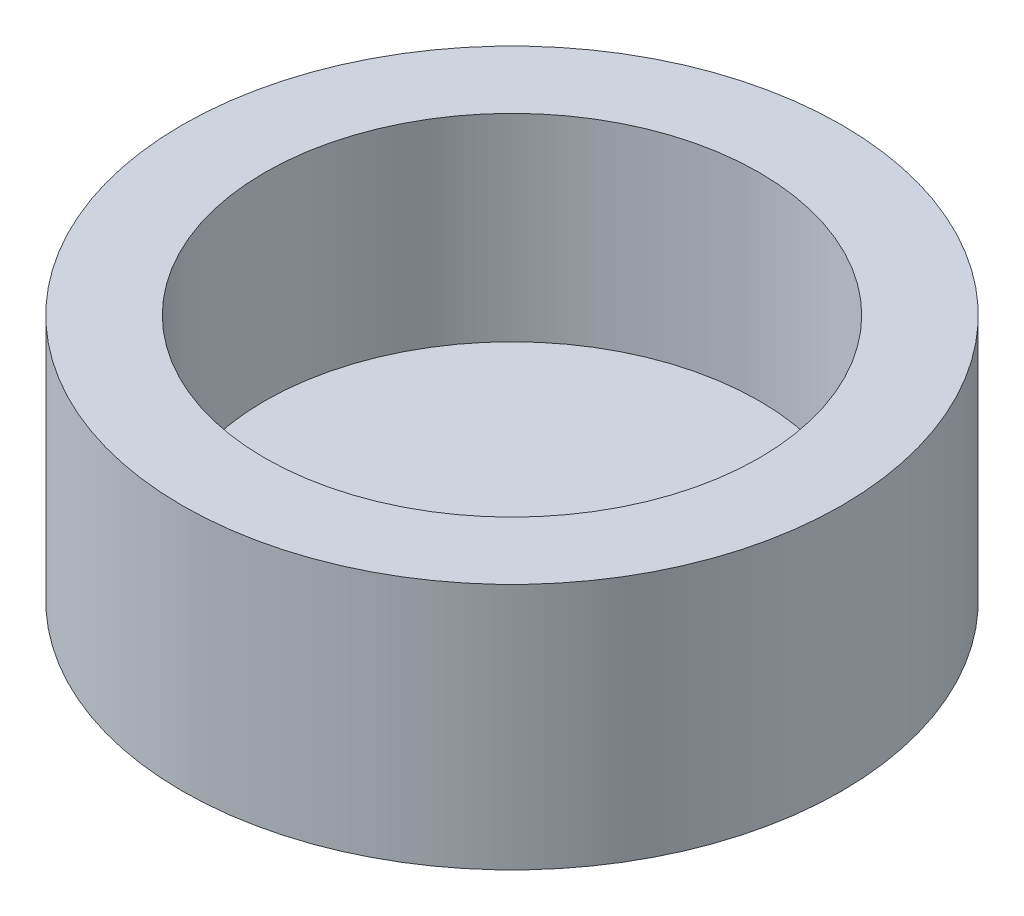
ISO-10303-21;
HEADER;
FILE_DESCRIPTION(('STEP AP214'),'2;1');
FILE_NAME('part.step','',(''),(''),'','','');
FILE_SCHEMA(('AUTOMOTIVE_DESIGN { 1 0 10303 214 1 1 1 1 }'));
ENDSEC;
DATA;
#1=APPLICATION_CONTEXT('core data for automotive mechanical design processes');
#2=APPLICATION_PROTOCOL_DEFINITION('international standard','automotive_design',2000,#1);
#3=PRODUCT_CONTEXT('',#1,'mechanical');
#4=PRODUCT('Part','Part','',(#3));
#5=PRODUCT_RELATED_PRODUCT_CATEGORY('part','',(#4));
#6=PRODUCT_DEFINITION_FORMATION('','',#4);
#7=PRODUCT_DEFINITION_CONTEXT('part definition',#1,'design');
#8=PRODUCT_DEFINITION('design','',#6,#7);
#9=PRODUCT_DEFINITION_SHAPE('','',#8);
#10=(LENGTH_UNIT() NAMED_UNIT(*) SI_UNIT(.MILLI.,.METRE.));
#11=(NAMED_UNIT(*) PLANE_ANGLE_UNIT() SI_UNIT($,.RADIAN.));
#12=(NAMED_UNIT(*) SI_UNIT($,.STERADIAN.) SOLID_ANGLE_UNIT());
#13=UNCERTAINTY_MEASURE_WITH_UNIT(LENGTH_MEASURE(1.E-05),#10,'distance_accuracy_value','');
#14=(GEOMETRIC_REPRESENTATION_CONTEXT(3) GLOBAL_UNCERTAINTY_ASSIGNED_CONTEXT((#13)) GLOBAL_UNIT_ASSIGNED_CONTEXT((#10,
#11,#12)) REPRESENTATION_CONTEXT('',''));
#15=CARTESIAN_POINT('',(0.,0.,0.));
#16=DIRECTION('',(0.,0.,1.));
#17=DIRECTION('',(1.,0.,0.));
#18=AXIS2_PLACEMENT_3D('',#15,#16,#17);
#19=CARTESIAN_POINT('',(0.,19.05,0.));
#20=DIRECTION('',(0.,-1.,0.));
#21=DIRECTION('',(0.,0.,-1.));
#22=AXIS2_PLACEMENT_3D('',#19,#20,#21);
#23=CYLINDRICAL_SURFACE('',#22,25.4);
#24=CARTESIAN_POINT('',(0.,19.05,0.));
#25=DIRECTION('',(0.,1.,0.));
#26=DIRECTION('',(0.,0.,1.));
#27=AXIS2_PLACEMENT_3D('',#24,#25,#26);
#28=CIRCLE('',#27,25.4);
#29=CARTESIAN_POINT('',(0.,19.05,25.4));
#30=VERTEX_POINT('',#29);
#31=EDGE_CURVE('E11',#30,#30,#28,.T.);
#32=ORIENTED_EDGE('',*,*,#31,.F.);
#33=EDGE_LOOP('',(#32));
#34=FACE_BOUND('',#33,.T.);
#35=CARTESIAN_POINT('',(0.,0.,0.));
#36=DIRECTION('',(0.,1.,0.));
#37=DIRECTION('',(0.,0.,1.));
#38=AXIS2_PLACEMENT_3D('',#35,#36,#37);
#39=CIRCLE('',#38,25.4);
#40=CARTESIAN_POINT('',(0.,0.,25.4));
#41=VERTEX_POINT('',#40);
#42=EDGE_CURVE('E36',#41,#41,#39,.T.);
#43=ORIENTED_EDGE('',*,*,#42,.T.);
#44=EDGE_LOOP('',(#43));
#45=FACE_BOUND('',#44,.T.);
#46=ADVANCED_FACE('F33',(#34,#45),#23,.T.);
#47=CARTESIAN_POINT('',(0.,19.05,0.));
#48=DIRECTION('',(0.,1.,0.));
#49=DIRECTION('',(0.,0.,1.));
#50=AXIS2_PLACEMENT_3D('',#47,#48,#49);
#51=PLANE('',#50);
#52=CARTESIAN_POINT('',(0.,19.05,0.));
#53=DIRECTION('',(0.,1.,0.));
#54=DIRECTION('',(0.,0.,1.));
#55=AXIS2_PLACEMENT_3D('',#52,#53,#54);
#56=CIRCLE('',#55,19.05);
#57=CARTESIAN_POINT('',(0.,19.05,19.05));
#58=VERTEX_POINT('',#57);
#59=EDGE_CURVE('E47',#58,#58,#56,.T.);
#60=ORIENTED_EDGE('',*,*,#59,.F.);
#61=EDGE_LOOP('',(#60));
#62=FACE_BOUND('',#61,.T.);
#63=ORIENTED_EDGE('',*,*,#31,.T.);
#64=EDGE_LOOP('',(#63));
#65=FACE_BOUND('',#64,.T.);
#66=ADVANCED_FACE('F53',(#62,#65),#51,.T.);
#67=CARTESIAN_POINT('',(0.,0.,0.));
#68=DIRECTION('',(0.,1.,0.));
#69=DIRECTION('',(0.,0.,1.));
#70=AXIS2_PLACEMENT_3D('',#67,#68,#69);
#71=PLANE('',#70);
#72=ORIENTED_EDGE('',*,*,#42,.F.);
#73=EDGE_LOOP('',(#72));
#74=FACE_BOUND('',#73,.T.);
#75=ADVANCED_FACE('F55',(#74),#71,.F.);
#76=CARTESIAN_POINT('',(0.,-53.8815367264149,0.));
#77=DIRECTION('',(0.,1.,0.));
#78=DIRECTION('',(0.,0.,1.));
#79=AXIS2_PLACEMENT_3D('',#76,#77,#78);
#80=CYLINDRICAL_SURFACE('',#79,19.05);
#81=CARTESIAN_POINT('',(0.,3.81,0.));
#82=DIRECTION('',(0.,1.,0.));
#83=DIRECTION('',(0.,0.,1.));
#84=AXIS2_PLACEMENT_3D('',#81,#82,#83);
#85=CIRCLE('',#84,19.05);
#86=CARTESIAN_POINT('',(0.,3.81,19.05));
#87=VERTEX_POINT('',#86);
#88=EDGE_CURVE('E43',#87,#87,#85,.F.);
#89=ORIENTED_EDGE('',*,*,#88,.T.);
#90=EDGE_LOOP('',(#89));
#91=FACE_BOUND('',#90,.T.);
#92=ORIENTED_EDGE('',*,*,#59,.T.);
#93=EDGE_LOOP('',(#92));
#94=FACE_BOUND('',#93,.T.);
#95=ADVANCED_FACE('F51',(#91,#94),#80,.F.);
#96=CARTESIAN_POINT('',(0.,3.81,0.));
#97=DIRECTION('',(0.,1.,0.));
#98=DIRECTION('',(0.,0.,1.));
#99=AXIS2_PLACEMENT_3D('',#96,#97,#98);
#100=PLANE('',#99);
#101=ORIENTED_EDGE('',*,*,#88,.F.);
#102=EDGE_LOOP('',(#101));
#103=FACE_BOUND('',#102,.T.);
#104=ADVANCED_FACE('F66',(#103),#100,.T.);
#105=CLOSED_SHELL('',(#46,#66,#75,#95,#104));
#106=MANIFOLD_SOLID_BREP('B2',#105);
#107=ADVANCED_BREP_SHAPE_REPRESENTATION('',(#18,#106),#14);
#108=SHAPE_DEFINITION_REPRESENTATION(#9,#107);
ENDSEC;
END-ISO-10303-21;
